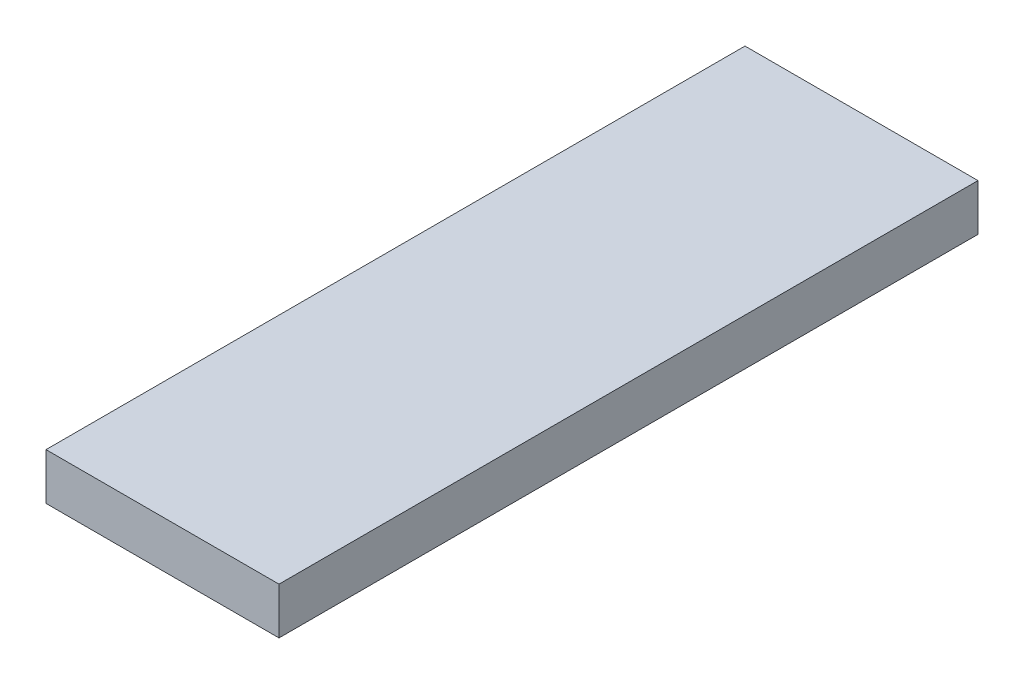
ISO-10303-21;
HEADER;
FILE_DESCRIPTION(('STEP AP214'),'2;1');
FILE_NAME('part.step','',(''),(''),'','','');
FILE_SCHEMA(('AUTOMOTIVE_DESIGN { 1 0 10303 214 1 1 1 1 }'));
ENDSEC;
DATA;
#1=APPLICATION_CONTEXT('core data for automotive mechanical design processes');
#2=APPLICATION_PROTOCOL_DEFINITION('international standard','automotive_design',2000,#1);
#3=PRODUCT_CONTEXT('',#1,'mechanical');
#4=PRODUCT('Part','Part','',(#3));
#5=PRODUCT_RELATED_PRODUCT_CATEGORY('part','',(#4));
#6=PRODUCT_DEFINITION_FORMATION('','',#4);
#7=PRODUCT_DEFINITION_CONTEXT('part definition',#1,'design');
#8=PRODUCT_DEFINITION('design','',#6,#7);
#9=PRODUCT_DEFINITION_SHAPE('','',#8);
#10=(LENGTH_UNIT() NAMED_UNIT(*) SI_UNIT(.MILLI.,.METRE.));
#11=(NAMED_UNIT(*) PLANE_ANGLE_UNIT() SI_UNIT($,.RADIAN.));
#12=(NAMED_UNIT(*) SI_UNIT($,.STERADIAN.) SOLID_ANGLE_UNIT());
#13=UNCERTAINTY_MEASURE_WITH_UNIT(LENGTH_MEASURE(1.E-05),#10,'distance_accuracy_value','');
#14=(GEOMETRIC_REPRESENTATION_CONTEXT(3) GLOBAL_UNCERTAINTY_ASSIGNED_CONTEXT((#13)) GLOBAL_UNIT_ASSIGNED_CONTEXT((#10,
#11,#12)) REPRESENTATION_CONTEXT('',''));
#15=CARTESIAN_POINT('',(0.,0.,0.));
#16=DIRECTION('',(0.,0.,1.));
#17=DIRECTION('',(1.,0.,0.));
#18=AXIS2_PLACEMENT_3D('',#15,#16,#17);
#19=CARTESIAN_POINT('',(5.,-1.,30.));
#20=DIRECTION('',(-1.,0.,0.));
#21=DIRECTION('',(0.,0.,1.));
#22=AXIS2_PLACEMENT_3D('',#19,#20,#21);
#23=PLANE('',#22);
#24=DIRECTION('',(0.,1.,0.));
#25=VECTOR('',#24,1.);
#26=CARTESIAN_POINT('',(5.,-1.,0.));
#27=LINE('',#26,#25);
#28=CARTESIAN_POINT('',(5.,-1.,0.));
#29=VERTEX_POINT('',#28);
#30=CARTESIAN_POINT('',(5.,1.,0.));
#31=VERTEX_POINT('',#30);
#32=EDGE_CURVE('E96',#29,#31,#27,.T.);
#33=ORIENTED_EDGE('',*,*,#32,.T.);
#34=DIRECTION('',(0.,0.,-1.));
#35=VECTOR('',#34,1.);
#36=CARTESIAN_POINT('',(5.,1.,30.));
#37=LINE('',#36,#35);
#38=CARTESIAN_POINT('',(5.,1.,30.));
#39=VERTEX_POINT('',#38);
#40=EDGE_CURVE('E11',#39,#31,#37,.T.);
#41=ORIENTED_EDGE('',*,*,#40,.F.);
#42=DIRECTION('',(0.,1.,0.));
#43=VECTOR('',#42,1.);
#44=CARTESIAN_POINT('',(5.,-1.,30.));
#45=LINE('',#44,#43);
#46=CARTESIAN_POINT('',(5.,-1.,30.));
#47=VERTEX_POINT('',#46);
#48=EDGE_CURVE('E84',#47,#39,#45,.T.);
#49=ORIENTED_EDGE('',*,*,#48,.F.);
#50=DIRECTION('',(0.,0.,-1.));
#51=VECTOR('',#50,1.);
#52=CARTESIAN_POINT('',(5.,-1.,30.));
#53=LINE('',#52,#51);
#54=EDGE_CURVE('E92',#47,#29,#53,.T.);
#55=ORIENTED_EDGE('',*,*,#54,.T.);
#56=EDGE_LOOP('',(#33,#41,#49,#55));
#57=FACE_BOUND('',#56,.T.);
#58=ADVANCED_FACE('F33',(#57),#23,.F.);
#59=CARTESIAN_POINT('',(-5.,1.,30.));
#60=DIRECTION('',(0.,-1.,0.));
#61=DIRECTION('',(0.,0.,-1.));
#62=AXIS2_PLACEMENT_3D('',#59,#60,#61);
#63=PLANE('',#62);
#64=DIRECTION('',(-1.,0.,0.));
#65=VECTOR('',#64,1.);
#66=CARTESIAN_POINT('',(-5.,1.,0.));
#67=LINE('',#66,#65);
#68=CARTESIAN_POINT('',(-5.,1.,0.));
#69=VERTEX_POINT('',#68);
#70=EDGE_CURVE('E88',#31,#69,#67,.T.);
#71=ORIENTED_EDGE('',*,*,#70,.T.);
#72=DIRECTION('',(0.,0.,-1.));
#73=VECTOR('',#72,1.);
#74=CARTESIAN_POINT('',(-5.,1.,30.));
#75=LINE('',#74,#73);
#76=CARTESIAN_POINT('',(-5.,1.,30.));
#77=VERTEX_POINT('',#76);
#78=EDGE_CURVE('E41',#77,#69,#75,.T.);
#79=ORIENTED_EDGE('',*,*,#78,.F.);
#80=DIRECTION('',(-1.,0.,0.));
#81=VECTOR('',#80,1.);
#82=CARTESIAN_POINT('',(-5.,1.,30.));
#83=LINE('',#82,#81);
#84=EDGE_CURVE('E79',#39,#77,#83,.T.);
#85=ORIENTED_EDGE('',*,*,#84,.F.);
#86=ORIENTED_EDGE('',*,*,#40,.T.);
#87=EDGE_LOOP('',(#71,#79,#85,#86));
#88=FACE_BOUND('',#87,.T.);
#89=ADVANCED_FACE('F87',(#88),#63,.F.);
#90=CARTESIAN_POINT('',(-5.,-1.,30.));
#91=DIRECTION('',(1.,0.,0.));
#92=DIRECTION('',(0.,0.,-1.));
#93=AXIS2_PLACEMENT_3D('',#90,#91,#92);
#94=PLANE('',#93);
#95=DIRECTION('',(0.,-1.,0.));
#96=VECTOR('',#95,1.);
#97=CARTESIAN_POINT('',(-5.,-1.,0.));
#98=LINE('',#97,#96);
#99=CARTESIAN_POINT('',(-5.,-1.,0.));
#100=VERTEX_POINT('',#99);
#101=EDGE_CURVE('E66',#69,#100,#98,.T.);
#102=ORIENTED_EDGE('',*,*,#101,.T.);
#103=DIRECTION('',(0.,0.,-1.));
#104=VECTOR('',#103,1.);
#105=CARTESIAN_POINT('',(-5.,-1.,30.));
#106=LINE('',#105,#104);
#107=CARTESIAN_POINT('',(-5.,-1.,30.));
#108=VERTEX_POINT('',#107);
#109=EDGE_CURVE('E89',#108,#100,#106,.T.);
#110=ORIENTED_EDGE('',*,*,#109,.F.);
#111=DIRECTION('',(0.,-1.,0.));
#112=VECTOR('',#111,1.);
#113=CARTESIAN_POINT('',(-5.,-1.,30.));
#114=LINE('',#113,#112);
#115=EDGE_CURVE('E82',#77,#108,#114,.T.);
#116=ORIENTED_EDGE('',*,*,#115,.F.);
#117=ORIENTED_EDGE('',*,*,#78,.T.);
#118=EDGE_LOOP('',(#102,#110,#116,#117));
#119=FACE_BOUND('',#118,.T.);
#120=ADVANCED_FACE('F90',(#119),#94,.F.);
#121=CARTESIAN_POINT('',(-5.,-1.,30.));
#122=DIRECTION('',(0.,1.,0.));
#123=DIRECTION('',(0.,0.,1.));
#124=AXIS2_PLACEMENT_3D('',#121,#122,#123);
#125=PLANE('',#124);
#126=DIRECTION('',(1.,0.,0.));
#127=VECTOR('',#126,1.);
#128=CARTESIAN_POINT('',(-5.,-1.,0.));
#129=LINE('',#128,#127);
#130=EDGE_CURVE('E72',#100,#29,#129,.T.);
#131=ORIENTED_EDGE('',*,*,#130,.T.);
#132=ORIENTED_EDGE('',*,*,#54,.F.);
#133=DIRECTION('',(1.,0.,0.));
#134=VECTOR('',#133,1.);
#135=CARTESIAN_POINT('',(-5.,-1.,30.));
#136=LINE('',#135,#134);
#137=EDGE_CURVE('E49',#108,#47,#136,.T.);
#138=ORIENTED_EDGE('',*,*,#137,.F.);
#139=ORIENTED_EDGE('',*,*,#109,.T.);
#140=EDGE_LOOP('',(#131,#132,#138,#139));
#141=FACE_BOUND('',#140,.T.);
#142=ADVANCED_FACE('F103',(#141),#125,.F.);
#143=CARTESIAN_POINT('',(0.,0.,30.));
#144=DIRECTION('',(0.,0.,-1.));
#145=DIRECTION('',(-1.,0.,0.));
#146=AXIS2_PLACEMENT_3D('',#143,#144,#145);
#147=PLANE('',#146);
#148=ORIENTED_EDGE('',*,*,#48,.T.);
#149=ORIENTED_EDGE('',*,*,#84,.T.);
#150=ORIENTED_EDGE('',*,*,#115,.T.);
#151=ORIENTED_EDGE('',*,*,#137,.T.);
#152=EDGE_LOOP('',(#148,#149,#150,#151));
#153=FACE_BOUND('',#152,.T.);
#154=ADVANCED_FACE('F80',(#153),#147,.F.);
#155=CARTESIAN_POINT('',(0.,0.,0.));
#156=DIRECTION('',(0.,0.,-1.));
#157=DIRECTION('',(-1.,0.,0.));
#158=AXIS2_PLACEMENT_3D('',#155,#156,#157);
#159=PLANE('',#158);
#160=ORIENTED_EDGE('',*,*,#32,.F.);
#161=ORIENTED_EDGE('',*,*,#130,.F.);
#162=ORIENTED_EDGE('',*,*,#101,.F.);
#163=ORIENTED_EDGE('',*,*,#70,.F.);
#164=EDGE_LOOP('',(#160,#161,#162,#163));
#165=FACE_BOUND('',#164,.T.);
#166=ADVANCED_FACE('F106',(#165),#159,.T.);
#167=CLOSED_SHELL('',(#58,#89,#120,#142,#154,#166));
#168=MANIFOLD_SOLID_BREP('B2',#167);
#169=ADVANCED_BREP_SHAPE_REPRESENTATION('',(#18,#168),#14);
#170=SHAPE_DEFINITION_REPRESENTATION(#9,#169);
ENDSEC;
END-ISO-10303-21;
